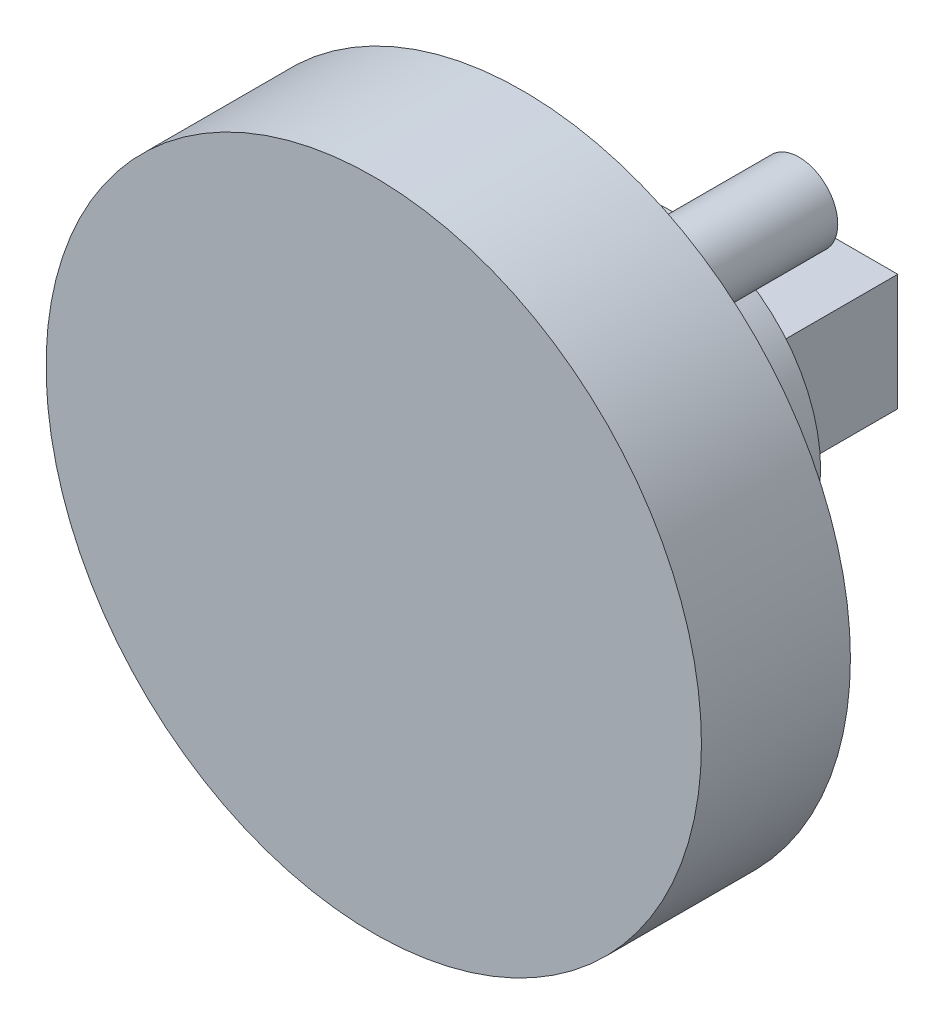
ISO-10303-21;
HEADER;
FILE_DESCRIPTION(('STEP AP214'),'2;1');
FILE_NAME('part.step','',(''),(''),'','','');
FILE_SCHEMA(('AUTOMOTIVE_DESIGN { 1 0 10303 214 1 1 1 1 }'));
ENDSEC;
DATA;
#1=APPLICATION_CONTEXT('core data for automotive mechanical design processes');
#2=APPLICATION_PROTOCOL_DEFINITION('international standard','automotive_design',2000,#1);
#3=PRODUCT_CONTEXT('',#1,'mechanical');
#4=PRODUCT('Part','Part','',(#3));
#5=PRODUCT_RELATED_PRODUCT_CATEGORY('part','',(#4));
#6=PRODUCT_DEFINITION_FORMATION('','',#4);
#7=PRODUCT_DEFINITION_CONTEXT('part definition',#1,'design');
#8=PRODUCT_DEFINITION('design','',#6,#7);
#9=PRODUCT_DEFINITION_SHAPE('','',#8);
#10=(LENGTH_UNIT() NAMED_UNIT(*) SI_UNIT(.MILLI.,.METRE.));
#11=(NAMED_UNIT(*) PLANE_ANGLE_UNIT() SI_UNIT($,.RADIAN.));
#12=(NAMED_UNIT(*) SI_UNIT($,.STERADIAN.) SOLID_ANGLE_UNIT());
#13=UNCERTAINTY_MEASURE_WITH_UNIT(LENGTH_MEASURE(1.E-05),#10,'distance_accuracy_value','');
#14=(GEOMETRIC_REPRESENTATION_CONTEXT(3) GLOBAL_UNCERTAINTY_ASSIGNED_CONTEXT((#13)) GLOBAL_UNIT_ASSIGNED_CONTEXT((#10,
#11,#12)) REPRESENTATION_CONTEXT('',''));
#15=CARTESIAN_POINT('',(0.,0.,0.));
#16=DIRECTION('',(0.,0.,1.));
#17=DIRECTION('',(1.,0.,0.));
#18=AXIS2_PLACEMENT_3D('',#15,#16,#17);
#19=CARTESIAN_POINT('',(0.,0.,-10.));
#20=DIRECTION('',(0.,0.,-1.));
#21=DIRECTION('',(-1.,0.,0.));
#22=AXIS2_PLACEMENT_3D('',#19,#20,#21);
#23=PLANE('',#22);
#24=CARTESIAN_POINT('',(0.,0.,-10.));
#25=DIRECTION('',(0.,0.,-1.));
#26=DIRECTION('',(-1.,0.,0.));
#27=AXIS2_PLACEMENT_3D('',#24,#25,#26);
#28=CIRCLE('',#27,10.);
#29=CARTESIAN_POINT('',(-10.,0.,-10.));
#30=VERTEX_POINT('',#29);
#31=EDGE_CURVE('E117',#30,#30,#28,.T.);
#32=ORIENTED_EDGE('',*,*,#31,.T.);
#33=EDGE_LOOP('',(#32));
#34=FACE_BOUND('',#33,.T.);
#35=DIRECTION('',(1.,0.,0.));
#36=VECTOR('',#35,1.);
#37=CARTESIAN_POINT('',(5.17700387868203,3.91150960366815,-10.));
#38=LINE('',#37,#36);
#39=CARTESIAN_POINT('',(-5.17700387868203,3.91150960366815,-10.));
#40=VERTEX_POINT('',#39);
#41=CARTESIAN_POINT('',(5.17700387868203,3.91150960366815,-10.));
#42=VERTEX_POINT('',#41);
#43=EDGE_CURVE('E87',#40,#42,#38,.T.);
#44=ORIENTED_EDGE('',*,*,#43,.F.);
#45=DIRECTION('',(0.,1.,0.));
#46=VECTOR('',#45,1.);
#47=CARTESIAN_POINT('',(-5.17700387868203,-3.91150960366815,-10.));
#48=LINE('',#47,#46);
#49=CARTESIAN_POINT('',(-5.17700387868203,-3.91150960366815,-10.));
#50=VERTEX_POINT('',#49);
#51=EDGE_CURVE('E98',#50,#40,#48,.T.);
#52=ORIENTED_EDGE('',*,*,#51,.F.);
#53=DIRECTION('',(-1.,0.,0.));
#54=VECTOR('',#53,1.);
#55=CARTESIAN_POINT('',(5.17700387868203,-3.91150960366815,-10.));
#56=LINE('',#55,#54);
#57=CARTESIAN_POINT('',(5.17700387868203,-3.91150960366815,-10.));
#58=VERTEX_POINT('',#57);
#59=EDGE_CURVE('E68',#58,#50,#56,.T.);
#60=ORIENTED_EDGE('',*,*,#59,.F.);
#61=DIRECTION('',(0.,-1.,0.));
#62=VECTOR('',#61,1.);
#63=CARTESIAN_POINT('',(5.17700387868203,-3.91150960366815,-10.));
#64=LINE('',#63,#62);
#65=EDGE_CURVE('E102',#42,#58,#64,.T.);
#66=ORIENTED_EDGE('',*,*,#65,.F.);
#67=EDGE_LOOP('',(#44,#52,#60,#66));
#68=FACE_BOUND('',#67,.T.);
#69=ADVANCED_FACE('F31',(#34,#68),#23,.T.);
#70=CARTESIAN_POINT('',(0.,0.,0.));
#71=DIRECTION('',(0.,0.,1.));
#72=DIRECTION('',(1.,0.,0.));
#73=AXIS2_PLACEMENT_3D('',#70,#71,#72);
#74=PLANE('',#73);
#75=CARTESIAN_POINT('',(8.55,-14.8090344047139,0.));
#76=DIRECTION('',(0.,0.,1.));
#77=DIRECTION('',(1.,0.,0.));
#78=AXIS2_PLACEMENT_3D('',#75,#76,#77);
#79=CIRCLE('',#78,2.6);
#80=CARTESIAN_POINT('',(11.15,-14.8090344047139,0.));
#81=VERTEX_POINT('',#80);
#82=EDGE_CURVE('E39',#81,#81,#79,.F.);
#83=ORIENTED_EDGE('',*,*,#82,.F.);
#84=EDGE_LOOP('',(#83));
#85=FACE_BOUND('',#84,.T.);
#86=CARTESIAN_POINT('',(0.,0.,0.));
#87=DIRECTION('',(0.,0.,1.));
#88=DIRECTION('',(1.,0.,0.));
#89=AXIS2_PLACEMENT_3D('',#86,#87,#88);
#90=CIRCLE('',#89,10.);
#91=CARTESIAN_POINT('',(10.,0.,0.));
#92=VERTEX_POINT('',#91);
#93=EDGE_CURVE('E124',#92,#92,#90,.F.);
#94=ORIENTED_EDGE('',*,*,#93,.F.);
#95=EDGE_LOOP('',(#94));
#96=FACE_BOUND('',#95,.T.);
#97=CARTESIAN_POINT('',(0.,0.,0.));
#98=DIRECTION('',(0.,0.,1.));
#99=DIRECTION('',(1.,0.,0.));
#100=AXIS2_PLACEMENT_3D('',#97,#98,#99);
#101=CIRCLE('',#100,22.);
#102=CARTESIAN_POINT('',(22.,0.,0.));
#103=VERTEX_POINT('',#102);
#104=EDGE_CURVE('E120',#103,#103,#101,.T.);
#105=ORIENTED_EDGE('',*,*,#104,.F.);
#106=EDGE_LOOP('',(#105));
#107=FACE_BOUND('',#106,.T.);
#108=CARTESIAN_POINT('',(-17.1,0.,0.));
#109=DIRECTION('',(0.,0.,1.));
#110=DIRECTION('',(1.,0.,0.));
#111=AXIS2_PLACEMENT_3D('',#108,#109,#110);
#112=CIRCLE('',#111,2.6);
#113=CARTESIAN_POINT('',(-14.5,0.,0.));
#114=VERTEX_POINT('',#113);
#115=EDGE_CURVE('E129',#114,#114,#112,.F.);
#116=ORIENTED_EDGE('',*,*,#115,.F.);
#117=EDGE_LOOP('',(#116));
#118=FACE_BOUND('',#117,.T.);
#119=CARTESIAN_POINT('',(8.54999999999999,14.8090344047139,0.));
#120=DIRECTION('',(0.,0.,1.));
#121=DIRECTION('',(1.,0.,0.));
#122=AXIS2_PLACEMENT_3D('',#119,#120,#121);
#123=CIRCLE('',#122,2.6);
#124=CARTESIAN_POINT('',(11.15,14.8090344047139,0.));
#125=VERTEX_POINT('',#124);
#126=EDGE_CURVE('E11',#125,#125,#123,.F.);
#127=ORIENTED_EDGE('',*,*,#126,.F.);
#128=EDGE_LOOP('',(#127));
#129=FACE_BOUND('',#128,.T.);
#130=ADVANCED_FACE('F136',(#85,#96,#107,#118,#129),#74,.F.);
#131=CARTESIAN_POINT('',(0.,0.,10.));
#132=DIRECTION('',(0.,0.,-1.));
#133=DIRECTION('',(-1.,0.,0.));
#134=AXIS2_PLACEMENT_3D('',#131,#132,#133);
#135=CYLINDRICAL_SURFACE('',#134,22.);
#136=CARTESIAN_POINT('',(0.,0.,10.));
#137=DIRECTION('',(0.,0.,1.));
#138=DIRECTION('',(1.,0.,0.));
#139=AXIS2_PLACEMENT_3D('',#136,#137,#138);
#140=CIRCLE('',#139,22.);
#141=CARTESIAN_POINT('',(22.,0.,10.));
#142=VERTEX_POINT('',#141);
#143=EDGE_CURVE('E121',#142,#142,#140,.T.);
#144=ORIENTED_EDGE('',*,*,#143,.F.);
#145=EDGE_LOOP('',(#144));
#146=FACE_BOUND('',#145,.T.);
#147=ORIENTED_EDGE('',*,*,#104,.T.);
#148=EDGE_LOOP('',(#147));
#149=FACE_BOUND('',#148,.T.);
#150=ADVANCED_FACE('F33',(#146,#149),#135,.T.);
#151=CARTESIAN_POINT('',(0.,0.,10.));
#152=DIRECTION('',(0.,0.,1.));
#153=DIRECTION('',(1.,0.,0.));
#154=AXIS2_PLACEMENT_3D('',#151,#152,#153);
#155=PLANE('',#154);
#156=ORIENTED_EDGE('',*,*,#143,.T.);
#157=EDGE_LOOP('',(#156));
#158=FACE_BOUND('',#157,.T.);
#159=ADVANCED_FACE('F176',(#158),#155,.T.);
#160=CARTESIAN_POINT('',(0.,0.,-10.));
#161=DIRECTION('',(0.,0.,1.));
#162=DIRECTION('',(1.,0.,0.));
#163=AXIS2_PLACEMENT_3D('',#160,#161,#162);
#164=CYLINDRICAL_SURFACE('',#163,10.);
#165=ORIENTED_EDGE('',*,*,#31,.F.);
#166=EDGE_LOOP('',(#165));
#167=FACE_BOUND('',#166,.T.);
#168=ORIENTED_EDGE('',*,*,#93,.T.);
#169=EDGE_LOOP('',(#168));
#170=FACE_BOUND('',#169,.T.);
#171=ADVANCED_FACE('F173',(#167,#170),#164,.T.);
#172=CARTESIAN_POINT('',(-17.1,0.,-10.));
#173=DIRECTION('',(0.,0.,1.));
#174=DIRECTION('',(1.,0.,0.));
#175=AXIS2_PLACEMENT_3D('',#172,#173,#174);
#176=CYLINDRICAL_SURFACE('',#175,2.6);
#177=CARTESIAN_POINT('',(-17.1,0.,-10.));
#178=DIRECTION('',(0.,0.,-1.));
#179=DIRECTION('',(-1.,0.,0.));
#180=AXIS2_PLACEMENT_3D('',#177,#178,#179);
#181=CIRCLE('',#180,2.6);
#182=CARTESIAN_POINT('',(-19.7,0.,-10.));
#183=VERTEX_POINT('',#182);
#184=EDGE_CURVE('E114',#183,#183,#181,.T.);
#185=ORIENTED_EDGE('',*,*,#184,.F.);
#186=EDGE_LOOP('',(#185));
#187=FACE_BOUND('',#186,.T.);
#188=ORIENTED_EDGE('',*,*,#115,.T.);
#189=EDGE_LOOP('',(#188));
#190=FACE_BOUND('',#189,.T.);
#191=ADVANCED_FACE('F171',(#187,#190),#176,.T.);
#192=CARTESIAN_POINT('',(-17.1,0.,-10.));
#193=DIRECTION('',(0.,0.,-1.));
#194=DIRECTION('',(-1.,0.,0.));
#195=AXIS2_PLACEMENT_3D('',#192,#193,#194);
#196=PLANE('',#195);
#197=ORIENTED_EDGE('',*,*,#184,.T.);
#198=EDGE_LOOP('',(#197));
#199=FACE_BOUND('',#198,.T.);
#200=ADVANCED_FACE('F204',(#199),#196,.T.);
#201=CARTESIAN_POINT('',(8.55,-14.8090344047139,-10.));
#202=DIRECTION('',(0.,0.,1.));
#203=DIRECTION('',(1.,0.,0.));
#204=AXIS2_PLACEMENT_3D('',#201,#202,#203);
#205=CYLINDRICAL_SURFACE('',#204,2.6);
#206=CARTESIAN_POINT('',(8.55,-14.8090344047139,-10.));
#207=DIRECTION('',(0.,0.,-1.));
#208=DIRECTION('',(-1.,0.,0.));
#209=AXIS2_PLACEMENT_3D('',#206,#207,#208);
#210=CIRCLE('',#209,2.6);
#211=CARTESIAN_POINT('',(5.94999999999999,-14.8090344047139,-10.));
#212=VERTEX_POINT('',#211);
#213=EDGE_CURVE('E111',#212,#212,#210,.T.);
#214=ORIENTED_EDGE('',*,*,#213,.F.);
#215=EDGE_LOOP('',(#214));
#216=FACE_BOUND('',#215,.T.);
#217=ORIENTED_EDGE('',*,*,#82,.T.);
#218=EDGE_LOOP('',(#217));
#219=FACE_BOUND('',#218,.T.);
#220=ADVANCED_FACE('F134',(#216,#219),#205,.T.);
#221=CARTESIAN_POINT('',(8.55,-14.8090344047139,-10.));
#222=DIRECTION('',(0.,0.,-1.));
#223=DIRECTION('',(-1.,0.,0.));
#224=AXIS2_PLACEMENT_3D('',#221,#222,#223);
#225=PLANE('',#224);
#226=ORIENTED_EDGE('',*,*,#213,.T.);
#227=EDGE_LOOP('',(#226));
#228=FACE_BOUND('',#227,.T.);
#229=ADVANCED_FACE('F150',(#228),#225,.T.);
#230=CARTESIAN_POINT('',(8.54999999999999,14.8090344047139,-10.));
#231=DIRECTION('',(0.,0.,1.));
#232=DIRECTION('',(1.,0.,0.));
#233=AXIS2_PLACEMENT_3D('',#230,#231,#232);
#234=CYLINDRICAL_SURFACE('',#233,2.6);
#235=CARTESIAN_POINT('',(8.54999999999999,14.8090344047139,-10.));
#236=DIRECTION('',(0.,0.,-1.));
#237=DIRECTION('',(-1.,0.,0.));
#238=AXIS2_PLACEMENT_3D('',#235,#236,#237);
#239=CIRCLE('',#238,2.6);
#240=CARTESIAN_POINT('',(5.94999999999999,14.8090344047139,-10.));
#241=VERTEX_POINT('',#240);
#242=EDGE_CURVE('E108',#241,#241,#239,.T.);
#243=ORIENTED_EDGE('',*,*,#242,.F.);
#244=EDGE_LOOP('',(#243));
#245=FACE_BOUND('',#244,.T.);
#246=ORIENTED_EDGE('',*,*,#126,.T.);
#247=EDGE_LOOP('',(#246));
#248=FACE_BOUND('',#247,.T.);
#249=ADVANCED_FACE('F147',(#245,#248),#234,.T.);
#250=CARTESIAN_POINT('',(8.54999999999999,14.8090344047139,-10.));
#251=DIRECTION('',(0.,0.,-1.));
#252=DIRECTION('',(-1.,0.,0.));
#253=AXIS2_PLACEMENT_3D('',#250,#251,#252);
#254=PLANE('',#253);
#255=ORIENTED_EDGE('',*,*,#242,.T.);
#256=EDGE_LOOP('',(#255));
#257=FACE_BOUND('',#256,.T.);
#258=ADVANCED_FACE('F149',(#257),#254,.T.);
#259=CARTESIAN_POINT('',(-5.17700387868203,-3.91150960366815,-20.));
#260=DIRECTION('',(1.,0.,0.));
#261=DIRECTION('',(0.,0.,-1.));
#262=AXIS2_PLACEMENT_3D('',#259,#260,#261);
#263=PLANE('',#262);
#264=ORIENTED_EDGE('',*,*,#51,.T.);
#265=DIRECTION('',(0.,0.,1.));
#266=VECTOR('',#265,1.);
#267=CARTESIAN_POINT('',(-5.17700387868203,3.91150960366815,-20.));
#268=LINE('',#267,#266);
#269=CARTESIAN_POINT('',(-5.17700387868203,3.91150960366815,-20.));
#270=VERTEX_POINT('',#269);
#271=EDGE_CURVE('E90',#270,#40,#268,.T.);
#272=ORIENTED_EDGE('',*,*,#271,.F.);
#273=DIRECTION('',(0.,1.,0.));
#274=VECTOR('',#273,1.);
#275=CARTESIAN_POINT('',(-5.17700387868203,-3.91150960366815,-20.));
#276=LINE('',#275,#274);
#277=CARTESIAN_POINT('',(-5.17700387868203,-3.91150960366815,-20.));
#278=VERTEX_POINT('',#277);
#279=EDGE_CURVE('E80',#278,#270,#276,.T.);
#280=ORIENTED_EDGE('',*,*,#279,.F.);
#281=DIRECTION('',(0.,0.,1.));
#282=VECTOR('',#281,1.);
#283=CARTESIAN_POINT('',(-5.17700387868203,-3.91150960366815,-20.));
#284=LINE('',#283,#282);
#285=EDGE_CURVE('E94',#278,#50,#284,.T.);
#286=ORIENTED_EDGE('',*,*,#285,.T.);
#287=EDGE_LOOP('',(#264,#272,#280,#286));
#288=FACE_BOUND('',#287,.T.);
#289=ADVANCED_FACE('F157',(#288),#263,.F.);
#290=CARTESIAN_POINT('',(5.17700387868203,3.91150960366815,-20.));
#291=DIRECTION('',(0.,-1.,0.));
#292=DIRECTION('',(0.,0.,-1.));
#293=AXIS2_PLACEMENT_3D('',#290,#291,#292);
#294=PLANE('',#293);
#295=ORIENTED_EDGE('',*,*,#43,.T.);
#296=DIRECTION('',(0.,0.,1.));
#297=VECTOR('',#296,1.);
#298=CARTESIAN_POINT('',(5.17700387868203,3.91150960366815,-20.));
#299=LINE('',#298,#297);
#300=CARTESIAN_POINT('',(5.17700387868203,3.91150960366815,-20.));
#301=VERTEX_POINT('',#300);
#302=EDGE_CURVE('E84',#301,#42,#299,.T.);
#303=ORIENTED_EDGE('',*,*,#302,.F.);
#304=DIRECTION('',(1.,0.,0.));
#305=VECTOR('',#304,1.);
#306=CARTESIAN_POINT('',(5.17700387868203,3.91150960366815,-20.));
#307=LINE('',#306,#305);
#308=EDGE_CURVE('E75',#270,#301,#307,.T.);
#309=ORIENTED_EDGE('',*,*,#308,.F.);
#310=ORIENTED_EDGE('',*,*,#271,.T.);
#311=EDGE_LOOP('',(#295,#303,#309,#310));
#312=FACE_BOUND('',#311,.T.);
#313=ADVANCED_FACE('F85',(#312),#294,.F.);
#314=CARTESIAN_POINT('',(5.17700387868203,-3.91150960366815,-20.));
#315=DIRECTION('',(-1.,0.,0.));
#316=DIRECTION('',(0.,0.,1.));
#317=AXIS2_PLACEMENT_3D('',#314,#315,#316);
#318=PLANE('',#317);
#319=ORIENTED_EDGE('',*,*,#65,.T.);
#320=DIRECTION('',(0.,0.,1.));
#321=VECTOR('',#320,1.);
#322=CARTESIAN_POINT('',(5.17700387868203,-3.91150960366815,-20.));
#323=LINE('',#322,#321);
#324=CARTESIAN_POINT('',(5.17700387868203,-3.91150960366815,-20.));
#325=VERTEX_POINT('',#324);
#326=EDGE_CURVE('E46',#325,#58,#323,.T.);
#327=ORIENTED_EDGE('',*,*,#326,.F.);
#328=DIRECTION('',(0.,-1.,0.));
#329=VECTOR('',#328,1.);
#330=CARTESIAN_POINT('',(5.17700387868203,-3.91150960366815,-20.));
#331=LINE('',#330,#329);
#332=EDGE_CURVE('E78',#301,#325,#331,.T.);
#333=ORIENTED_EDGE('',*,*,#332,.F.);
#334=ORIENTED_EDGE('',*,*,#302,.T.);
#335=EDGE_LOOP('',(#319,#327,#333,#334));
#336=FACE_BOUND('',#335,.T.);
#337=ADVANCED_FACE('F92',(#336),#318,.F.);
#338=CARTESIAN_POINT('',(5.17700387868203,-3.91150960366815,-20.));
#339=DIRECTION('',(0.,1.,0.));
#340=DIRECTION('',(0.,0.,1.));
#341=AXIS2_PLACEMENT_3D('',#338,#339,#340);
#342=PLANE('',#341);
#343=ORIENTED_EDGE('',*,*,#59,.T.);
#344=ORIENTED_EDGE('',*,*,#285,.F.);
#345=DIRECTION('',(-1.,0.,0.));
#346=VECTOR('',#345,1.);
#347=CARTESIAN_POINT('',(5.17700387868203,-3.91150960366815,-20.));
#348=LINE('',#347,#346);
#349=EDGE_CURVE('E54',#325,#278,#348,.T.);
#350=ORIENTED_EDGE('',*,*,#349,.F.);
#351=ORIENTED_EDGE('',*,*,#326,.T.);
#352=EDGE_LOOP('',(#343,#344,#350,#351));
#353=FACE_BOUND('',#352,.T.);
#354=ADVANCED_FACE('F267',(#353),#342,.F.);
#355=CARTESIAN_POINT('',(-5.17700387868203,3.91150960366815,-20.));
#356=DIRECTION('',(0.,0.,1.));
#357=DIRECTION('',(1.,0.,0.));
#358=AXIS2_PLACEMENT_3D('',#355,#356,#357);
#359=PLANE('',#358);
#360=ORIENTED_EDGE('',*,*,#279,.T.);
#361=ORIENTED_EDGE('',*,*,#308,.T.);
#362=ORIENTED_EDGE('',*,*,#332,.T.);
#363=ORIENTED_EDGE('',*,*,#349,.T.);
#364=EDGE_LOOP('',(#360,#361,#362,#363));
#365=FACE_BOUND('',#364,.T.);
#366=ADVANCED_FACE('F76',(#365),#359,.F.);
#367=CLOSED_SHELL('',(#69,#130,#150,#159,#171,#191,#200,#220,#229,#249,#258,#289,#313,#337,#354,#366));
#368=MANIFOLD_SOLID_BREP('B2',#367);
#369=ADVANCED_BREP_SHAPE_REPRESENTATION('',(#18,#368),#14);
#370=SHAPE_DEFINITION_REPRESENTATION(#9,#369);
ENDSEC;
END-ISO-10303-21;
